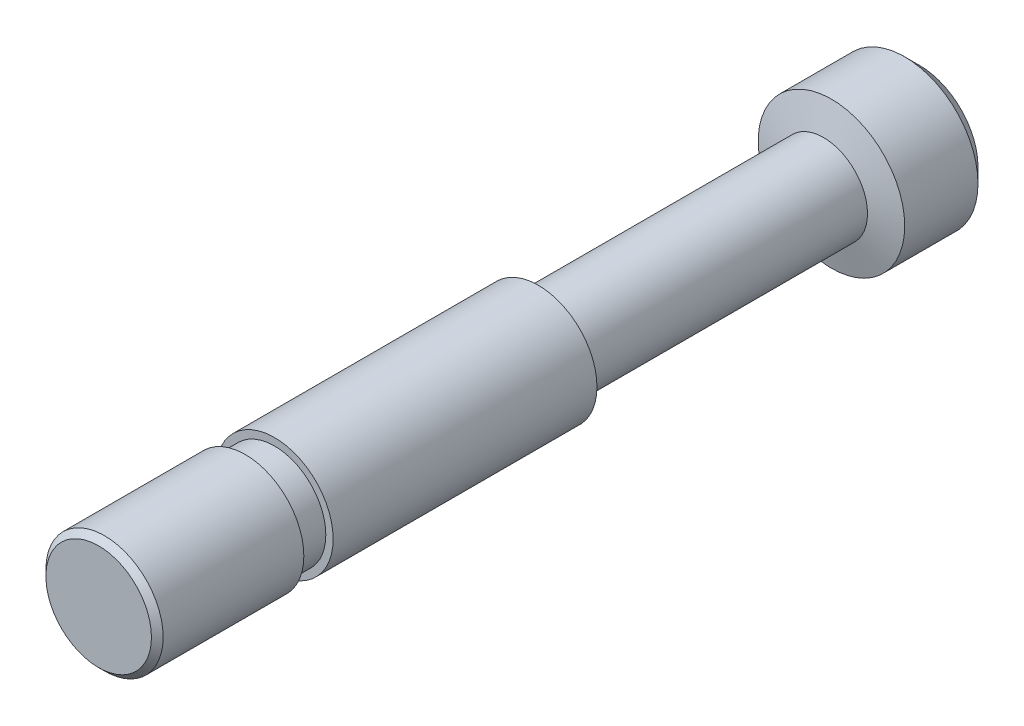
ISO-10303-21;
HEADER;
FILE_DESCRIPTION(('STEP AP214'),'2;1');
FILE_NAME('part.step','',(''),(''),'','','');
FILE_SCHEMA(('AUTOMOTIVE_DESIGN { 1 0 10303 214 1 1 1 1 }'));
ENDSEC;
DATA;
#1=APPLICATION_CONTEXT('core data for automotive mechanical design processes');
#2=APPLICATION_PROTOCOL_DEFINITION('international standard','automotive_design',2000,#1);
#3=PRODUCT_CONTEXT('',#1,'mechanical');
#4=PRODUCT('Part','Part','',(#3));
#5=PRODUCT_RELATED_PRODUCT_CATEGORY('part','',(#4));
#6=PRODUCT_DEFINITION_FORMATION('','',#4);
#7=PRODUCT_DEFINITION_CONTEXT('part definition',#1,'design');
#8=PRODUCT_DEFINITION('design','',#6,#7);
#9=PRODUCT_DEFINITION_SHAPE('','',#8);
#10=(LENGTH_UNIT() NAMED_UNIT(*) SI_UNIT(.MILLI.,.METRE.));
#11=(NAMED_UNIT(*) PLANE_ANGLE_UNIT() SI_UNIT($,.RADIAN.));
#12=(NAMED_UNIT(*) SI_UNIT($,.STERADIAN.) SOLID_ANGLE_UNIT());
#13=UNCERTAINTY_MEASURE_WITH_UNIT(LENGTH_MEASURE(1.E-05),#10,'distance_accuracy_value','');
#14=(GEOMETRIC_REPRESENTATION_CONTEXT(3) GLOBAL_UNCERTAINTY_ASSIGNED_CONTEXT((#13)) GLOBAL_UNIT_ASSIGNED_CONTEXT((#10,
#11,#12)) REPRESENTATION_CONTEXT('',''));
#15=CARTESIAN_POINT('',(0.,0.,0.));
#16=DIRECTION('',(0.,0.,1.));
#17=DIRECTION('',(1.,0.,0.));
#18=AXIS2_PLACEMENT_3D('',#15,#16,#17);
#19=CARTESIAN_POINT('',(0.,0.,-15.29));
#20=DIRECTION('',(0.,0.,1.));
#21=DIRECTION('',(1.,0.,0.));
#22=AXIS2_PLACEMENT_3D('',#19,#20,#21);
#23=CYLINDRICAL_SURFACE('',#22,2.);
#24=CARTESIAN_POINT('',(0.,0.,-15.));
#25=DIRECTION('',(0.,0.,1.));
#26=DIRECTION('',(1.,0.,0.));
#27=AXIS2_PLACEMENT_3D('',#24,#25,#26);
#28=CIRCLE('',#27,2.);
#29=CARTESIAN_POINT('',(2.,0.,-15.));
#30=VERTEX_POINT('',#29);
#31=EDGE_CURVE('E20',#30,#30,#28,.T.);
#32=ORIENTED_EDGE('',*,*,#31,.T.);
#33=EDGE_LOOP('',(#32));
#34=FACE_BOUND('',#33,.T.);
#35=CARTESIAN_POINT('',(0.,0.,-6.));
#36=DIRECTION('',(0.,0.,1.));
#37=DIRECTION('',(1.,0.,0.));
#38=AXIS2_PLACEMENT_3D('',#35,#36,#37);
#39=CIRCLE('',#38,2.);
#40=CARTESIAN_POINT('',(2.,0.,-6.));
#41=VERTEX_POINT('',#40);
#42=EDGE_CURVE('E39',#41,#41,#39,.F.);
#43=ORIENTED_EDGE('',*,*,#42,.T.);
#44=EDGE_LOOP('',(#43));
#45=FACE_BOUND('',#44,.T.);
#46=ADVANCED_FACE('F13',(#34,#45),#23,.T.);
#47=CARTESIAN_POINT('',(0.,0.,-6.));
#48=DIRECTION('',(0.,0.,1.));
#49=DIRECTION('',(1.,0.,0.));
#50=AXIS2_PLACEMENT_3D('',#47,#48,#49);
#51=PLANE('',#50);
#52=ORIENTED_EDGE('',*,*,#42,.F.);
#53=EDGE_LOOP('',(#52));
#54=FACE_BOUND('',#53,.T.);
#55=CARTESIAN_POINT('',(0.,0.,-6.));
#56=DIRECTION('',(0.,0.,1.));
#57=DIRECTION('',(1.,0.,0.));
#58=AXIS2_PLACEMENT_3D('',#55,#56,#57);
#59=CIRCLE('',#58,1.75);
#60=CARTESIAN_POINT('',(1.75,0.,-6.));
#61=VERTEX_POINT('',#60);
#62=EDGE_CURVE('E45',#61,#61,#59,.T.);
#63=ORIENTED_EDGE('',*,*,#62,.F.);
#64=EDGE_LOOP('',(#63));
#65=FACE_BOUND('',#64,.T.);
#66=ADVANCED_FACE('F71',(#54,#65),#51,.T.);
#67=CARTESIAN_POINT('',(0.,0.,-5.));
#68=DIRECTION('',(0.,0.,1.));
#69=DIRECTION('',(1.,0.,0.));
#70=AXIS2_PLACEMENT_3D('',#67,#68,#69);
#71=PLANE('',#70);
#72=CARTESIAN_POINT('',(0.,0.,-5.));
#73=DIRECTION('',(0.,0.,1.));
#74=DIRECTION('',(1.,0.,0.));
#75=AXIS2_PLACEMENT_3D('',#72,#73,#74);
#76=CIRCLE('',#75,2.);
#77=CARTESIAN_POINT('',(2.,0.,-5.));
#78=VERTEX_POINT('',#77);
#79=EDGE_CURVE('E42',#78,#78,#76,.F.);
#80=ORIENTED_EDGE('',*,*,#79,.T.);
#81=EDGE_LOOP('',(#80));
#82=FACE_BOUND('',#81,.T.);
#83=CARTESIAN_POINT('',(0.,0.,-5.));
#84=DIRECTION('',(0.,0.,1.));
#85=DIRECTION('',(1.,0.,0.));
#86=AXIS2_PLACEMENT_3D('',#83,#84,#85);
#87=CIRCLE('',#86,1.75);
#88=CARTESIAN_POINT('',(1.75,0.,-5.));
#89=VERTEX_POINT('',#88);
#90=EDGE_CURVE('E46',#89,#89,#87,.T.);
#91=ORIENTED_EDGE('',*,*,#90,.T.);
#92=EDGE_LOOP('',(#91));
#93=FACE_BOUND('',#92,.T.);
#94=ADVANCED_FACE('F77',(#82,#93),#71,.F.);
#95=CARTESIAN_POINT('',(0.,0.,-6.));
#96=DIRECTION('',(0.,0.,1.));
#97=DIRECTION('',(1.,0.,0.));
#98=AXIS2_PLACEMENT_3D('',#95,#96,#97);
#99=CYLINDRICAL_SURFACE('',#98,1.75);
#100=ORIENTED_EDGE('',*,*,#62,.T.);
#101=EDGE_LOOP('',(#100));
#102=FACE_BOUND('',#101,.T.);
#103=ORIENTED_EDGE('',*,*,#90,.F.);
#104=EDGE_LOOP('',(#103));
#105=FACE_BOUND('',#104,.T.);
#106=ADVANCED_FACE('F92',(#102,#105),#99,.T.);
#107=CARTESIAN_POINT('',(0.,0.,0.));
#108=DIRECTION('',(0.,0.,1.));
#109=DIRECTION('',(1.,0.,0.));
#110=AXIS2_PLACEMENT_3D('',#107,#108,#109);
#111=PLANE('',#110);
#112=CARTESIAN_POINT('',(0.,0.,0.));
#113=DIRECTION('',(0.,0.,1.));
#114=DIRECTION('',(1.,0.,0.));
#115=AXIS2_PLACEMENT_3D('',#112,#113,#114);
#116=CIRCLE('',#115,1.8);
#117=CARTESIAN_POINT('',(1.8,0.,0.));
#118=VERTEX_POINT('',#117);
#119=EDGE_CURVE('E36',#118,#118,#116,.T.);
#120=ORIENTED_EDGE('',*,*,#119,.T.);
#121=EDGE_LOOP('',(#120));
#122=FACE_BOUND('',#121,.T.);
#123=ADVANCED_FACE('F84',(#122),#111,.T.);
#124=CARTESIAN_POINT('',(0.,0.,-0.200000000000001));
#125=DIRECTION('',(0.,0.,1.));
#126=DIRECTION('',(1.,0.,0.));
#127=AXIS2_PLACEMENT_3D('',#124,#125,#126);
#128=CIRCLE('',#127,2.);
#129=CARTESIAN_POINT('',(2.,0.,-0.200000000000001));
#130=VERTEX_POINT('',#129);
#131=EDGE_CURVE('E33',#130,#130,#128,.F.);
#132=ORIENTED_EDGE('',*,*,#131,.T.);
#133=EDGE_LOOP('',(#132));
#134=FACE_BOUND('',#133,.T.);
#135=ORIENTED_EDGE('',*,*,#79,.F.);
#136=EDGE_LOOP('',(#135));
#137=FACE_BOUND('',#136,.T.);
#138=ADVANCED_FACE('F73',(#134,#137),#23,.T.);
#139=CARTESIAN_POINT('',(0.,0.,-24.73));
#140=DIRECTION('',(0.,0.,1.));
#141=DIRECTION('',(1.,0.,0.));
#142=AXIS2_PLACEMENT_3D('',#139,#140,#141);
#143=CYLINDRICAL_SURFACE('',#142,1.5);
#144=CARTESIAN_POINT('',(0.,0.,-24.73));
#145=DIRECTION('',(0.,0.,1.));
#146=DIRECTION('',(1.,0.,0.));
#147=AXIS2_PLACEMENT_3D('',#144,#145,#146);
#148=CIRCLE('',#147,1.5);
#149=CARTESIAN_POINT('',(1.5,0.,-24.73));
#150=VERTEX_POINT('',#149);
#151=EDGE_CURVE('E49',#150,#150,#148,.T.);
#152=ORIENTED_EDGE('',*,*,#151,.T.);
#153=EDGE_LOOP('',(#152));
#154=FACE_BOUND('',#153,.T.);
#155=CARTESIAN_POINT('',(0.,0.,-15.29));
#156=DIRECTION('',(0.,0.,1.));
#157=DIRECTION('',(1.,0.,0.));
#158=AXIS2_PLACEMENT_3D('',#155,#156,#157);
#159=CIRCLE('',#158,1.5);
#160=CARTESIAN_POINT('',(1.5,0.,-15.29));
#161=VERTEX_POINT('',#160);
#162=EDGE_CURVE('E52',#161,#161,#159,.T.);
#163=ORIENTED_EDGE('',*,*,#162,.F.);
#164=EDGE_LOOP('',(#163));
#165=FACE_BOUND('',#164,.T.);
#166=ADVANCED_FACE('F58',(#154,#165),#143,.T.);
#167=CARTESIAN_POINT('',(0.,0.,-28.));
#168=DIRECTION('',(0.,0.,1.));
#169=DIRECTION('',(1.,0.,0.));
#170=AXIS2_PLACEMENT_3D('',#167,#168,#169);
#171=PLANE('',#170);
#172=CARTESIAN_POINT('',(0.,0.,-28.));
#173=DIRECTION('',(0.,0.,1.));
#174=DIRECTION('',(1.,0.,0.));
#175=AXIS2_PLACEMENT_3D('',#172,#173,#174);
#176=CIRCLE('',#175,1.99999999999999);
#177=CARTESIAN_POINT('',(1.99999999999999,0.,-28.));
#178=VERTEX_POINT('',#177);
#179=EDGE_CURVE('E24',#178,#178,#176,.F.);
#180=ORIENTED_EDGE('',*,*,#179,.T.);
#181=EDGE_LOOP('',(#180));
#182=FACE_BOUND('',#181,.T.);
#183=ADVANCED_FACE('F90',(#182),#171,.F.);
#184=CARTESIAN_POINT('',(0.,0.,-28.));
#185=DIRECTION('',(0.,0.,1.));
#186=DIRECTION('',(1.,0.,0.));
#187=AXIS2_PLACEMENT_3D('',#184,#185,#186);
#188=CYLINDRICAL_SURFACE('',#187,2.5);
#189=CARTESIAN_POINT('',(0.,0.,-25.));
#190=DIRECTION('',(0.,0.,1.));
#191=DIRECTION('',(1.,0.,0.));
#192=AXIS2_PLACEMENT_3D('',#189,#190,#191);
#193=CIRCLE('',#192,2.5);
#194=CARTESIAN_POINT('',(2.5,0.,-25.));
#195=VERTEX_POINT('',#194);
#196=EDGE_CURVE('E9',#195,#195,#193,.F.);
#197=ORIENTED_EDGE('',*,*,#196,.T.);
#198=EDGE_LOOP('',(#197));
#199=FACE_BOUND('',#198,.T.);
#200=CARTESIAN_POINT('',(0.,0.,-27.5));
#201=DIRECTION('',(0.,0.,1.));
#202=DIRECTION('',(1.,0.,0.));
#203=AXIS2_PLACEMENT_3D('',#200,#201,#202);
#204=CIRCLE('',#203,2.5);
#205=CARTESIAN_POINT('',(2.5,0.,-27.5));
#206=VERTEX_POINT('',#205);
#207=EDGE_CURVE('E28',#206,#206,#204,.T.);
#208=ORIENTED_EDGE('',*,*,#207,.T.);
#209=EDGE_LOOP('',(#208));
#210=FACE_BOUND('',#209,.T.);
#211=ADVANCED_FACE('F144',(#199,#210),#188,.T.);
#212=CARTESIAN_POINT('',(0.,0.,0.));
#213=DIRECTION('',(0.,0.,-1.));
#214=DIRECTION('',(-1.,0.,0.));
#215=AXIS2_PLACEMENT_3D('',#212,#213,#214);
#216=CONICAL_SURFACE('',#215,1.8,0.785398163397448);
#217=ORIENTED_EDGE('',*,*,#131,.F.);
#218=EDGE_LOOP('',(#217));
#219=FACE_BOUND('',#218,.T.);
#220=ORIENTED_EDGE('',*,*,#119,.F.);
#221=EDGE_LOOP('',(#220));
#222=FACE_BOUND('',#221,.T.);
#223=ADVANCED_FACE('F154',(#219,#222),#216,.T.);
#224=CARTESIAN_POINT('',(0.,0.,-27.5));
#225=DIRECTION('',(0.,0.,1.));
#226=DIRECTION('',(1.,0.,0.));
#227=AXIS2_PLACEMENT_3D('',#224,#225,#226);
#228=CONICAL_SURFACE('',#227,2.5,0.785398163397453);
#229=ORIENTED_EDGE('',*,*,#179,.F.);
#230=EDGE_LOOP('',(#229));
#231=FACE_BOUND('',#230,.T.);
#232=ORIENTED_EDGE('',*,*,#207,.F.);
#233=EDGE_LOOP('',(#232));
#234=FACE_BOUND('',#233,.T.);
#235=ADVANCED_FACE('F68',(#231,#234),#228,.T.);
#236=CARTESIAN_POINT('',(0.,0.,-15.29));
#237=DIRECTION('',(0.,0.,1.));
#238=DIRECTION('',(1.,0.,0.));
#239=AXIS2_PLACEMENT_3D('',#236,#237,#238);
#240=CONICAL_SURFACE('',#239,1.5,1.04521253324329);
#241=ORIENTED_EDGE('',*,*,#31,.F.);
#242=EDGE_LOOP('',(#241));
#243=FACE_BOUND('',#242,.T.);
#244=ORIENTED_EDGE('',*,*,#162,.T.);
#245=EDGE_LOOP('',(#244));
#246=FACE_BOUND('',#245,.T.);
#247=ADVANCED_FACE('F62',(#243,#246),#240,.T.);
#248=CARTESIAN_POINT('',(0.,0.,-24.73));
#249=DIRECTION('',(0.,0.,-1.));
#250=DIRECTION('',(-1.,0.,0.));
#251=AXIS2_PLACEMENT_3D('',#248,#249,#250);
#252=CONICAL_SURFACE('',#251,1.49999999999998,1.30708449233263);
#253=ORIENTED_EDGE('',*,*,#196,.F.);
#254=EDGE_LOOP('',(#253));
#255=FACE_BOUND('',#254,.T.);
#256=ORIENTED_EDGE('',*,*,#151,.F.);
#257=EDGE_LOOP('',(#256));
#258=FACE_BOUND('',#257,.T.);
#259=ADVANCED_FACE('F15',(#255,#258),#252,.T.);
#260=CLOSED_SHELL('',(#46,#66,#94,#106,#123,#138,#166,#183,#211,#223,#235,#247,#259));
#261=MANIFOLD_SOLID_BREP('B1',#260);
#262=ADVANCED_BREP_SHAPE_REPRESENTATION('',(#18,#261),#14);
#263=SHAPE_DEFINITION_REPRESENTATION(#9,#262);
ENDSEC;
END-ISO-10303-21;
